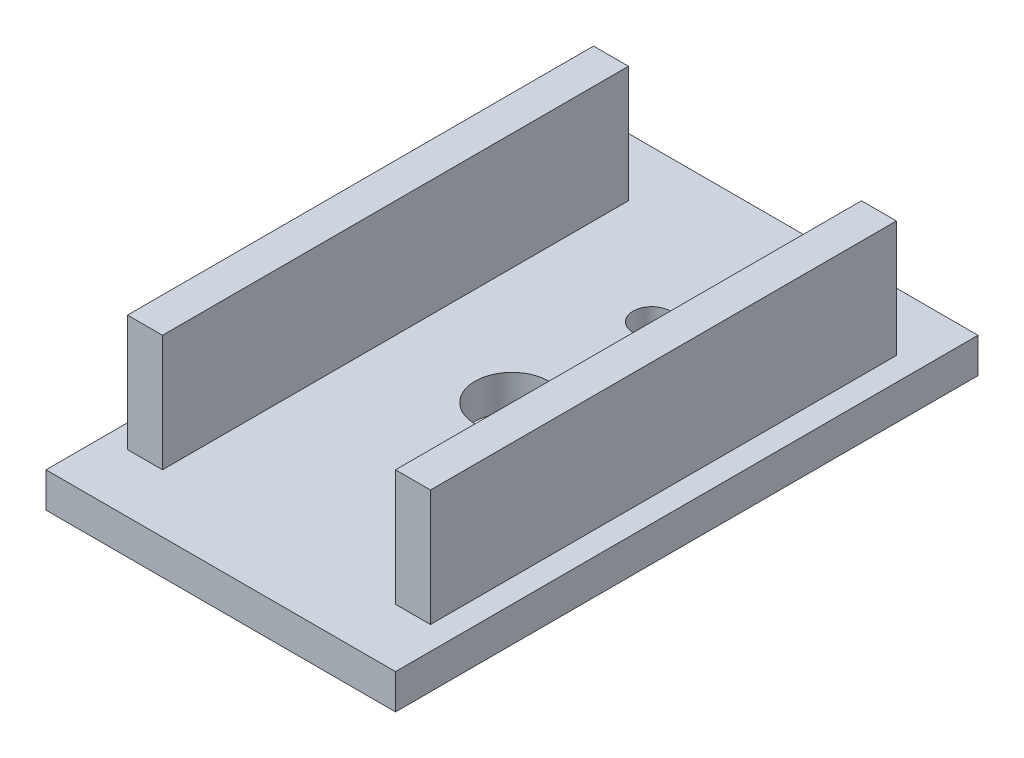
ISO-10303-21;
HEADER;
FILE_DESCRIPTION(('STEP AP214'),'2;1');
FILE_NAME('part.step','',(''),(''),'','','');
FILE_SCHEMA(('AUTOMOTIVE_DESIGN { 1 0 10303 214 1 1 1 1 }'));
ENDSEC;
DATA;
#1=APPLICATION_CONTEXT('core data for automotive mechanical design processes');
#2=APPLICATION_PROTOCOL_DEFINITION('international standard','automotive_design',2000,#1);
#3=PRODUCT_CONTEXT('',#1,'mechanical');
#4=PRODUCT('Part','Part','',(#3));
#5=PRODUCT_RELATED_PRODUCT_CATEGORY('part','',(#4));
#6=PRODUCT_DEFINITION_FORMATION('','',#4);
#7=PRODUCT_DEFINITION_CONTEXT('part definition',#1,'design');
#8=PRODUCT_DEFINITION('design','',#6,#7);
#9=PRODUCT_DEFINITION_SHAPE('','',#8);
#10=(LENGTH_UNIT() NAMED_UNIT(*) SI_UNIT(.MILLI.,.METRE.));
#11=(NAMED_UNIT(*) PLANE_ANGLE_UNIT() SI_UNIT($,.RADIAN.));
#12=(NAMED_UNIT(*) SI_UNIT($,.STERADIAN.) SOLID_ANGLE_UNIT());
#13=UNCERTAINTY_MEASURE_WITH_UNIT(LENGTH_MEASURE(1.E-05),#10,'distance_accuracy_value','');
#14=(GEOMETRIC_REPRESENTATION_CONTEXT(3) GLOBAL_UNCERTAINTY_ASSIGNED_CONTEXT((#13)) GLOBAL_UNIT_ASSIGNED_CONTEXT((#10,
#11,#12)) REPRESENTATION_CONTEXT('',''));
#15=CARTESIAN_POINT('',(0.,0.,0.));
#16=DIRECTION('',(0.,0.,1.));
#17=DIRECTION('',(1.,0.,0.));
#18=AXIS2_PLACEMENT_3D('',#15,#16,#17);
#19=CARTESIAN_POINT('',(0.,1.5,0.));
#20=DIRECTION('',(0.,1.,0.));
#21=DIRECTION('',(0.,0.,1.));
#22=AXIS2_PLACEMENT_3D('',#19,#20,#21);
#23=PLANE('',#22);
#24=DIRECTION('',(0.,0.,1.));
#25=VECTOR('',#24,1.);
#26=CARTESIAN_POINT('',(-10.,1.5,-20.));
#27=LINE('',#26,#25);
#28=CARTESIAN_POINT('',(-10.,1.5,-20.));
#29=VERTEX_POINT('',#28);
#30=CARTESIAN_POINT('',(-10.,1.5,20.));
#31=VERTEX_POINT('',#30);
#32=EDGE_CURVE('E127',#29,#31,#27,.T.);
#33=ORIENTED_EDGE('',*,*,#32,.T.);
#34=DIRECTION('',(-1.,0.,0.));
#35=VECTOR('',#34,1.);
#36=CARTESIAN_POINT('',(-10.,1.5,20.));
#37=LINE('',#36,#35);
#38=CARTESIAN_POINT('',(-13.,1.5,20.));
#39=VERTEX_POINT('',#38);
#40=EDGE_CURVE('E141',#31,#39,#37,.T.);
#41=ORIENTED_EDGE('',*,*,#40,.T.);
#42=DIRECTION('',(0.,0.,-1.));
#43=VECTOR('',#42,1.);
#44=CARTESIAN_POINT('',(-13.,1.5,-20.));
#45=LINE('',#44,#43);
#46=CARTESIAN_POINT('',(-13.,1.5,-20.));
#47=VERTEX_POINT('',#46);
#48=EDGE_CURVE('E53',#39,#47,#45,.T.);
#49=ORIENTED_EDGE('',*,*,#48,.T.);
#50=DIRECTION('',(1.,0.,0.));
#51=VECTOR('',#50,1.);
#52=CARTESIAN_POINT('',(-10.,1.5,-20.));
#53=LINE('',#52,#51);
#54=EDGE_CURVE('E48',#47,#29,#53,.T.);
#55=ORIENTED_EDGE('',*,*,#54,.T.);
#56=EDGE_LOOP('',(#33,#41,#49,#55));
#57=FACE_BOUND('',#56,.T.);
#58=CARTESIAN_POINT('',(0.,1.5,-12.));
#59=DIRECTION('',(0.,1.,0.));
#60=DIRECTION('',(0.,0.,1.));
#61=AXIS2_PLACEMENT_3D('',#58,#59,#60);
#62=CIRCLE('',#61,1.6);
#63=CARTESIAN_POINT('',(0.,1.5,-10.4));
#64=VERTEX_POINT('',#63);
#65=EDGE_CURVE('E187',#64,#64,#62,.T.);
#66=ORIENTED_EDGE('',*,*,#65,.F.);
#67=EDGE_LOOP('',(#66));
#68=FACE_BOUND('',#67,.T.);
#69=CARTESIAN_POINT('',(0.,1.5,0.));
#70=DIRECTION('',(0.,1.,0.));
#71=DIRECTION('',(0.,0.,1.));
#72=AXIS2_PLACEMENT_3D('',#69,#70,#71);
#73=CIRCLE('',#72,3.175);
#74=CARTESIAN_POINT('',(0.,1.5,3.175));
#75=VERTEX_POINT('',#74);
#76=EDGE_CURVE('E193',#75,#75,#73,.T.);
#77=ORIENTED_EDGE('',*,*,#76,.F.);
#78=EDGE_LOOP('',(#77));
#79=FACE_BOUND('',#78,.T.);
#80=DIRECTION('',(0.,0.,-1.));
#81=VECTOR('',#80,1.);
#82=CARTESIAN_POINT('',(15.,1.5,-25.));
#83=LINE('',#82,#81);
#84=CARTESIAN_POINT('',(15.,1.5,25.));
#85=VERTEX_POINT('',#84);
#86=CARTESIAN_POINT('',(15.,1.5,-25.));
#87=VERTEX_POINT('',#86);
#88=EDGE_CURVE('E200',#85,#87,#83,.T.);
#89=ORIENTED_EDGE('',*,*,#88,.T.);
#90=DIRECTION('',(-1.,0.,0.));
#91=VECTOR('',#90,1.);
#92=CARTESIAN_POINT('',(-15.,1.5,-25.));
#93=LINE('',#92,#91);
#94=CARTESIAN_POINT('',(-15.,1.5,-25.));
#95=VERTEX_POINT('',#94);
#96=EDGE_CURVE('E203',#87,#95,#93,.T.);
#97=ORIENTED_EDGE('',*,*,#96,.T.);
#98=DIRECTION('',(0.,0.,1.));
#99=VECTOR('',#98,1.);
#100=CARTESIAN_POINT('',(-15.,1.5,-25.));
#101=LINE('',#100,#99);
#102=CARTESIAN_POINT('',(-15.,1.5,25.));
#103=VERTEX_POINT('',#102);
#104=EDGE_CURVE('E206',#95,#103,#101,.T.);
#105=ORIENTED_EDGE('',*,*,#104,.T.);
#106=DIRECTION('',(1.,0.,0.));
#107=VECTOR('',#106,1.);
#108=CARTESIAN_POINT('',(-15.,1.5,25.));
#109=LINE('',#108,#107);
#110=EDGE_CURVE('E208',#103,#85,#109,.T.);
#111=ORIENTED_EDGE('',*,*,#110,.T.);
#112=EDGE_LOOP('',(#89,#97,#105,#111));
#113=FACE_BOUND('',#112,.T.);
#114=DIRECTION('',(1.,0.,0.));
#115=VECTOR('',#114,1.);
#116=CARTESIAN_POINT('',(10.,1.5,20.));
#117=LINE('',#116,#115);
#118=CARTESIAN_POINT('',(10.,1.5,20.));
#119=VERTEX_POINT('',#118);
#120=CARTESIAN_POINT('',(13.,1.5,20.));
#121=VERTEX_POINT('',#120);
#122=EDGE_CURVE('E172',#119,#121,#117,.T.);
#123=ORIENTED_EDGE('',*,*,#122,.F.);
#124=DIRECTION('',(0.,0.,1.));
#125=VECTOR('',#124,1.);
#126=CARTESIAN_POINT('',(10.,1.5,-20.));
#127=LINE('',#126,#125);
#128=CARTESIAN_POINT('',(10.,1.5,-20.));
#129=VERTEX_POINT('',#128);
#130=EDGE_CURVE('E130',#129,#119,#127,.T.);
#131=ORIENTED_EDGE('',*,*,#130,.F.);
#132=DIRECTION('',(-1.,0.,0.));
#133=VECTOR('',#132,1.);
#134=CARTESIAN_POINT('',(10.,1.5,-20.));
#135=LINE('',#134,#133);
#136=CARTESIAN_POINT('',(13.,1.5,-20.));
#137=VERTEX_POINT('',#136);
#138=EDGE_CURVE('E163',#137,#129,#135,.T.);
#139=ORIENTED_EDGE('',*,*,#138,.F.);
#140=DIRECTION('',(0.,0.,-1.));
#141=VECTOR('',#140,1.);
#142=CARTESIAN_POINT('',(13.,1.5,-20.));
#143=LINE('',#142,#141);
#144=EDGE_CURVE('E174',#121,#137,#143,.T.);
#145=ORIENTED_EDGE('',*,*,#144,.F.);
#146=EDGE_LOOP('',(#123,#131,#139,#145));
#147=FACE_BOUND('',#146,.T.);
#148=ADVANCED_FACE('F33',(#57,#68,#79,#113,#147),#23,.T.);
#149=CARTESIAN_POINT('',(15.,1.5,-25.));
#150=DIRECTION('',(-1.,0.,0.));
#151=DIRECTION('',(0.,0.,1.));
#152=AXIS2_PLACEMENT_3D('',#149,#150,#151);
#153=PLANE('',#152);
#154=DIRECTION('',(0.,0.,-1.));
#155=VECTOR('',#154,1.);
#156=CARTESIAN_POINT('',(15.,-1.5,-25.));
#157=LINE('',#156,#155);
#158=CARTESIAN_POINT('',(15.,-1.5,25.));
#159=VERTEX_POINT('',#158);
#160=CARTESIAN_POINT('',(15.,-1.5,-25.));
#161=VERTEX_POINT('',#160);
#162=EDGE_CURVE('E199',#159,#161,#157,.T.);
#163=ORIENTED_EDGE('',*,*,#162,.T.);
#164=DIRECTION('',(0.,-1.,0.));
#165=VECTOR('',#164,1.);
#166=CARTESIAN_POINT('',(15.,1.5,-25.));
#167=LINE('',#166,#165);
#168=EDGE_CURVE('E11',#87,#161,#167,.T.);
#169=ORIENTED_EDGE('',*,*,#168,.F.);
#170=ORIENTED_EDGE('',*,*,#88,.F.);
#171=DIRECTION('',(0.,-1.,0.));
#172=VECTOR('',#171,1.);
#173=CARTESIAN_POINT('',(15.,1.5,25.));
#174=LINE('',#173,#172);
#175=EDGE_CURVE('E210',#85,#159,#174,.T.);
#176=ORIENTED_EDGE('',*,*,#175,.T.);
#177=EDGE_LOOP('',(#163,#169,#170,#176));
#178=FACE_BOUND('',#177,.T.);
#179=ADVANCED_FACE('F35',(#178),#153,.F.);
#180=CARTESIAN_POINT('',(-15.,1.5,-25.));
#181=DIRECTION('',(0.,0.,1.));
#182=DIRECTION('',(1.,0.,0.));
#183=AXIS2_PLACEMENT_3D('',#180,#181,#182);
#184=PLANE('',#183);
#185=DIRECTION('',(-1.,0.,0.));
#186=VECTOR('',#185,1.);
#187=CARTESIAN_POINT('',(-15.,-1.5,-25.));
#188=LINE('',#187,#186);
#189=CARTESIAN_POINT('',(-15.,-1.5,-25.));
#190=VERTEX_POINT('',#189);
#191=EDGE_CURVE('E213',#161,#190,#188,.T.);
#192=ORIENTED_EDGE('',*,*,#191,.T.);
#193=DIRECTION('',(0.,-1.,0.));
#194=VECTOR('',#193,1.);
#195=CARTESIAN_POINT('',(-15.,1.5,-25.));
#196=LINE('',#195,#194);
#197=EDGE_CURVE('E41',#95,#190,#196,.T.);
#198=ORIENTED_EDGE('',*,*,#197,.F.);
#199=ORIENTED_EDGE('',*,*,#96,.F.);
#200=ORIENTED_EDGE('',*,*,#168,.T.);
#201=EDGE_LOOP('',(#192,#198,#199,#200));
#202=FACE_BOUND('',#201,.T.);
#203=ADVANCED_FACE('F243',(#202),#184,.F.);
#204=CARTESIAN_POINT('',(-15.,1.5,-25.));
#205=DIRECTION('',(1.,0.,0.));
#206=DIRECTION('',(0.,0.,-1.));
#207=AXIS2_PLACEMENT_3D('',#204,#205,#206);
#208=PLANE('',#207);
#209=DIRECTION('',(0.,0.,1.));
#210=VECTOR('',#209,1.);
#211=CARTESIAN_POINT('',(-15.,-1.5,-25.));
#212=LINE('',#211,#210);
#213=CARTESIAN_POINT('',(-15.,-1.5,25.));
#214=VERTEX_POINT('',#213);
#215=EDGE_CURVE('E215',#190,#214,#212,.T.);
#216=ORIENTED_EDGE('',*,*,#215,.T.);
#217=DIRECTION('',(0.,-1.,0.));
#218=VECTOR('',#217,1.);
#219=CARTESIAN_POINT('',(-15.,1.5,25.));
#220=LINE('',#219,#218);
#221=EDGE_CURVE('E220',#103,#214,#220,.T.);
#222=ORIENTED_EDGE('',*,*,#221,.F.);
#223=ORIENTED_EDGE('',*,*,#104,.F.);
#224=ORIENTED_EDGE('',*,*,#197,.T.);
#225=EDGE_LOOP('',(#216,#222,#223,#224));
#226=FACE_BOUND('',#225,.T.);
#227=ADVANCED_FACE('F227',(#226),#208,.F.);
#228=CARTESIAN_POINT('',(-15.,1.5,25.));
#229=DIRECTION('',(0.,0.,-1.));
#230=DIRECTION('',(-1.,0.,0.));
#231=AXIS2_PLACEMENT_3D('',#228,#229,#230);
#232=PLANE('',#231);
#233=DIRECTION('',(1.,0.,0.));
#234=VECTOR('',#233,1.);
#235=CARTESIAN_POINT('',(-15.,-1.5,25.));
#236=LINE('',#235,#234);
#237=EDGE_CURVE('E204',#214,#159,#236,.T.);
#238=ORIENTED_EDGE('',*,*,#237,.T.);
#239=ORIENTED_EDGE('',*,*,#175,.F.);
#240=ORIENTED_EDGE('',*,*,#110,.F.);
#241=ORIENTED_EDGE('',*,*,#221,.T.);
#242=EDGE_LOOP('',(#238,#239,#240,#241));
#243=FACE_BOUND('',#242,.T.);
#244=ADVANCED_FACE('F236',(#243),#232,.F.);
#245=CARTESIAN_POINT('',(0.,-1.5,0.));
#246=DIRECTION('',(0.,1.,0.));
#247=DIRECTION('',(0.,0.,1.));
#248=AXIS2_PLACEMENT_3D('',#245,#246,#247);
#249=PLANE('',#248);
#250=CARTESIAN_POINT('',(0.,-1.5,-12.));
#251=DIRECTION('',(0.,1.,0.));
#252=DIRECTION('',(0.,0.,1.));
#253=AXIS2_PLACEMENT_3D('',#250,#251,#252);
#254=CIRCLE('',#253,1.6);
#255=CARTESIAN_POINT('',(0.,-1.5,-10.4));
#256=VERTEX_POINT('',#255);
#257=EDGE_CURVE('E190',#256,#256,#254,.F.);
#258=ORIENTED_EDGE('',*,*,#257,.F.);
#259=EDGE_LOOP('',(#258));
#260=FACE_BOUND('',#259,.T.);
#261=CARTESIAN_POINT('',(0.,-1.5,0.));
#262=DIRECTION('',(0.,1.,0.));
#263=DIRECTION('',(0.,0.,1.));
#264=AXIS2_PLACEMENT_3D('',#261,#262,#263);
#265=CIRCLE('',#264,3.175);
#266=CARTESIAN_POINT('',(0.,-1.5,3.175));
#267=VERTEX_POINT('',#266);
#268=EDGE_CURVE('E196',#267,#267,#265,.F.);
#269=ORIENTED_EDGE('',*,*,#268,.F.);
#270=EDGE_LOOP('',(#269));
#271=FACE_BOUND('',#270,.T.);
#272=ORIENTED_EDGE('',*,*,#162,.F.);
#273=ORIENTED_EDGE('',*,*,#237,.F.);
#274=ORIENTED_EDGE('',*,*,#215,.F.);
#275=ORIENTED_EDGE('',*,*,#191,.F.);
#276=EDGE_LOOP('',(#272,#273,#274,#275));
#277=FACE_BOUND('',#276,.T.);
#278=ADVANCED_FACE('F233',(#260,#271,#277),#249,.F.);
#279=CARTESIAN_POINT('',(0.,-10.4802561210692,0.));
#280=DIRECTION('',(0.,1.,0.));
#281=DIRECTION('',(0.,0.,1.));
#282=AXIS2_PLACEMENT_3D('',#279,#280,#281);
#283=CYLINDRICAL_SURFACE('',#282,3.175);
#284=ORIENTED_EDGE('',*,*,#268,.T.);
#285=EDGE_LOOP('',(#284));
#286=FACE_BOUND('',#285,.T.);
#287=ORIENTED_EDGE('',*,*,#76,.T.);
#288=EDGE_LOOP('',(#287));
#289=FACE_BOUND('',#288,.T.);
#290=ADVANCED_FACE('F259',(#286,#289),#283,.F.);
#291=CARTESIAN_POINT('',(0.,-10.4802561210692,-12.));
#292=DIRECTION('',(0.,1.,0.));
#293=DIRECTION('',(0.,0.,1.));
#294=AXIS2_PLACEMENT_3D('',#291,#292,#293);
#295=CYLINDRICAL_SURFACE('',#294,1.6);
#296=ORIENTED_EDGE('',*,*,#257,.T.);
#297=EDGE_LOOP('',(#296));
#298=FACE_BOUND('',#297,.T.);
#299=ORIENTED_EDGE('',*,*,#65,.T.);
#300=EDGE_LOOP('',(#299));
#301=FACE_BOUND('',#300,.T.);
#302=ADVANCED_FACE('F279',(#298,#301),#295,.F.);
#303=CARTESIAN_POINT('',(10.,11.5,-20.));
#304=DIRECTION('',(1.,0.,0.));
#305=DIRECTION('',(0.,0.,-1.));
#306=AXIS2_PLACEMENT_3D('',#303,#304,#305);
#307=PLANE('',#306);
#308=ORIENTED_EDGE('',*,*,#130,.T.);
#309=DIRECTION('',(0.,-1.,0.));
#310=VECTOR('',#309,1.);
#311=CARTESIAN_POINT('',(10.,11.5,20.));
#312=LINE('',#311,#310);
#313=CARTESIAN_POINT('',(10.,11.5,20.));
#314=VERTEX_POINT('',#313);
#315=EDGE_CURVE('E185',#314,#119,#312,.T.);
#316=ORIENTED_EDGE('',*,*,#315,.F.);
#317=DIRECTION('',(0.,0.,1.));
#318=VECTOR('',#317,1.);
#319=CARTESIAN_POINT('',(10.,11.5,-20.));
#320=LINE('',#319,#318);
#321=CARTESIAN_POINT('',(10.,11.5,-20.));
#322=VERTEX_POINT('',#321);
#323=EDGE_CURVE('E159',#322,#314,#320,.T.);
#324=ORIENTED_EDGE('',*,*,#323,.F.);
#325=DIRECTION('',(0.,-1.,0.));
#326=VECTOR('',#325,1.);
#327=CARTESIAN_POINT('',(10.,11.5,-20.));
#328=LINE('',#327,#326);
#329=EDGE_CURVE('E169',#322,#129,#328,.T.);
#330=ORIENTED_EDGE('',*,*,#329,.T.);
#331=EDGE_LOOP('',(#308,#316,#324,#330));
#332=FACE_BOUND('',#331,.T.);
#333=ADVANCED_FACE('F286',(#332),#307,.F.);
#334=CARTESIAN_POINT('',(10.,11.5,20.));
#335=DIRECTION('',(0.,0.,-1.));
#336=DIRECTION('',(-1.,0.,0.));
#337=AXIS2_PLACEMENT_3D('',#334,#335,#336);
#338=PLANE('',#337);
#339=ORIENTED_EDGE('',*,*,#122,.T.);
#340=DIRECTION('',(0.,-1.,0.));
#341=VECTOR('',#340,1.);
#342=CARTESIAN_POINT('',(13.,11.5,20.));
#343=LINE('',#342,#341);
#344=CARTESIAN_POINT('',(13.,11.5,20.));
#345=VERTEX_POINT('',#344);
#346=EDGE_CURVE('E182',#345,#121,#343,.T.);
#347=ORIENTED_EDGE('',*,*,#346,.F.);
#348=DIRECTION('',(1.,0.,0.));
#349=VECTOR('',#348,1.);
#350=CARTESIAN_POINT('',(10.,11.5,20.));
#351=LINE('',#350,#349);
#352=EDGE_CURVE('E162',#314,#345,#351,.T.);
#353=ORIENTED_EDGE('',*,*,#352,.F.);
#354=ORIENTED_EDGE('',*,*,#315,.T.);
#355=EDGE_LOOP('',(#339,#347,#353,#354));
#356=FACE_BOUND('',#355,.T.);
#357=ADVANCED_FACE('F298',(#356),#338,.F.);
#358=CARTESIAN_POINT('',(13.,11.5,-20.));
#359=DIRECTION('',(-1.,0.,0.));
#360=DIRECTION('',(0.,0.,1.));
#361=AXIS2_PLACEMENT_3D('',#358,#359,#360);
#362=PLANE('',#361);
#363=ORIENTED_EDGE('',*,*,#144,.T.);
#364=DIRECTION('',(0.,-1.,0.));
#365=VECTOR('',#364,1.);
#366=CARTESIAN_POINT('',(13.,11.5,-20.));
#367=LINE('',#366,#365);
#368=CARTESIAN_POINT('',(13.,11.5,-20.));
#369=VERTEX_POINT('',#368);
#370=EDGE_CURVE('E180',#369,#137,#367,.T.);
#371=ORIENTED_EDGE('',*,*,#370,.F.);
#372=DIRECTION('',(0.,0.,-1.));
#373=VECTOR('',#372,1.);
#374=CARTESIAN_POINT('',(13.,11.5,-20.));
#375=LINE('',#374,#373);
#376=EDGE_CURVE('E165',#345,#369,#375,.T.);
#377=ORIENTED_EDGE('',*,*,#376,.F.);
#378=ORIENTED_EDGE('',*,*,#346,.T.);
#379=EDGE_LOOP('',(#363,#371,#377,#378));
#380=FACE_BOUND('',#379,.T.);
#381=ADVANCED_FACE('F305',(#380),#362,.F.);
#382=CARTESIAN_POINT('',(10.,11.5,-20.));
#383=DIRECTION('',(0.,0.,1.));
#384=DIRECTION('',(1.,0.,0.));
#385=AXIS2_PLACEMENT_3D('',#382,#383,#384);
#386=PLANE('',#385);
#387=ORIENTED_EDGE('',*,*,#138,.T.);
#388=ORIENTED_EDGE('',*,*,#329,.F.);
#389=DIRECTION('',(-1.,0.,0.));
#390=VECTOR('',#389,1.);
#391=CARTESIAN_POINT('',(10.,11.5,-20.));
#392=LINE('',#391,#390);
#393=EDGE_CURVE('E167',#369,#322,#392,.T.);
#394=ORIENTED_EDGE('',*,*,#393,.F.);
#395=ORIENTED_EDGE('',*,*,#370,.T.);
#396=EDGE_LOOP('',(#387,#388,#394,#395));
#397=FACE_BOUND('',#396,.T.);
#398=ADVANCED_FACE('F313',(#397),#386,.F.);
#399=CARTESIAN_POINT('',(0.,11.5,0.));
#400=DIRECTION('',(0.,1.,0.));
#401=DIRECTION('',(0.,0.,1.));
#402=AXIS2_PLACEMENT_3D('',#399,#400,#401);
#403=PLANE('',#402);
#404=ORIENTED_EDGE('',*,*,#323,.T.);
#405=ORIENTED_EDGE('',*,*,#352,.T.);
#406=ORIENTED_EDGE('',*,*,#376,.T.);
#407=ORIENTED_EDGE('',*,*,#393,.T.);
#408=EDGE_LOOP('',(#404,#405,#406,#407));
#409=FACE_BOUND('',#408,.T.);
#410=ADVANCED_FACE('F321',(#409),#403,.T.);
#411=CARTESIAN_POINT('',(-10.,11.5,-20.));
#412=DIRECTION('',(1.,0.,0.));
#413=DIRECTION('',(0.,0.,-1.));
#414=AXIS2_PLACEMENT_3D('',#411,#412,#413);
#415=PLANE('',#414);
#416=ORIENTED_EDGE('',*,*,#32,.F.);
#417=DIRECTION('',(0.,-1.,0.));
#418=VECTOR('',#417,1.);
#419=CARTESIAN_POINT('',(-10.,11.5,-20.));
#420=LINE('',#419,#418);
#421=CARTESIAN_POINT('',(-10.,11.5,-20.));
#422=VERTEX_POINT('',#421);
#423=EDGE_CURVE('E121',#422,#29,#420,.T.);
#424=ORIENTED_EDGE('',*,*,#423,.F.);
#425=DIRECTION('',(0.,0.,1.));
#426=VECTOR('',#425,1.);
#427=CARTESIAN_POINT('',(-10.,11.5,-20.));
#428=LINE('',#427,#426);
#429=CARTESIAN_POINT('',(-10.,11.5,20.));
#430=VERTEX_POINT('',#429);
#431=EDGE_CURVE('E125',#422,#430,#428,.T.);
#432=ORIENTED_EDGE('',*,*,#431,.T.);
#433=DIRECTION('',(0.,-1.,0.));
#434=VECTOR('',#433,1.);
#435=CARTESIAN_POINT('',(-10.,11.5,20.));
#436=LINE('',#435,#434);
#437=EDGE_CURVE('E149',#430,#31,#436,.T.);
#438=ORIENTED_EDGE('',*,*,#437,.T.);
#439=EDGE_LOOP('',(#416,#424,#432,#438));
#440=FACE_BOUND('',#439,.T.);
#441=ADVANCED_FACE('F123',(#440),#415,.T.);
#442=CARTESIAN_POINT('',(-10.,11.5,-20.));
#443=DIRECTION('',(0.,0.,-1.));
#444=DIRECTION('',(-1.,0.,0.));
#445=AXIS2_PLACEMENT_3D('',#442,#443,#444);
#446=PLANE('',#445);
#447=ORIENTED_EDGE('',*,*,#54,.F.);
#448=DIRECTION('',(0.,-1.,0.));
#449=VECTOR('',#448,1.);
#450=CARTESIAN_POINT('',(-13.,11.5,-20.));
#451=LINE('',#450,#449);
#452=CARTESIAN_POINT('',(-13.,11.5,-20.));
#453=VERTEX_POINT('',#452);
#454=EDGE_CURVE('E131',#453,#47,#451,.T.);
#455=ORIENTED_EDGE('',*,*,#454,.F.);
#456=DIRECTION('',(1.,0.,0.));
#457=VECTOR('',#456,1.);
#458=CARTESIAN_POINT('',(-10.,11.5,-20.));
#459=LINE('',#458,#457);
#460=EDGE_CURVE('E137',#453,#422,#459,.T.);
#461=ORIENTED_EDGE('',*,*,#460,.T.);
#462=ORIENTED_EDGE('',*,*,#423,.T.);
#463=EDGE_LOOP('',(#447,#455,#461,#462));
#464=FACE_BOUND('',#463,.T.);
#465=ADVANCED_FACE('F143',(#464),#446,.T.);
#466=CARTESIAN_POINT('',(-13.,11.5,-20.));
#467=DIRECTION('',(-1.,0.,0.));
#468=DIRECTION('',(0.,0.,1.));
#469=AXIS2_PLACEMENT_3D('',#466,#467,#468);
#470=PLANE('',#469);
#471=ORIENTED_EDGE('',*,*,#48,.F.);
#472=DIRECTION('',(0.,-1.,0.));
#473=VECTOR('',#472,1.);
#474=CARTESIAN_POINT('',(-13.,11.5,20.));
#475=LINE('',#474,#473);
#476=CARTESIAN_POINT('',(-13.,11.5,20.));
#477=VERTEX_POINT('',#476);
#478=EDGE_CURVE('E155',#477,#39,#475,.T.);
#479=ORIENTED_EDGE('',*,*,#478,.F.);
#480=DIRECTION('',(0.,0.,-1.));
#481=VECTOR('',#480,1.);
#482=CARTESIAN_POINT('',(-13.,11.5,-20.));
#483=LINE('',#482,#481);
#484=EDGE_CURVE('E144',#477,#453,#483,.T.);
#485=ORIENTED_EDGE('',*,*,#484,.T.);
#486=ORIENTED_EDGE('',*,*,#454,.T.);
#487=EDGE_LOOP('',(#471,#479,#485,#486));
#488=FACE_BOUND('',#487,.T.);
#489=ADVANCED_FACE('F340',(#488),#470,.T.);
#490=CARTESIAN_POINT('',(-10.,11.5,20.));
#491=DIRECTION('',(0.,0.,1.));
#492=DIRECTION('',(1.,0.,0.));
#493=AXIS2_PLACEMENT_3D('',#490,#491,#492);
#494=PLANE('',#493);
#495=ORIENTED_EDGE('',*,*,#40,.F.);
#496=ORIENTED_EDGE('',*,*,#437,.F.);
#497=DIRECTION('',(-1.,0.,0.));
#498=VECTOR('',#497,1.);
#499=CARTESIAN_POINT('',(-10.,11.5,20.));
#500=LINE('',#499,#498);
#501=EDGE_CURVE('E140',#430,#477,#500,.T.);
#502=ORIENTED_EDGE('',*,*,#501,.T.);
#503=ORIENTED_EDGE('',*,*,#478,.T.);
#504=EDGE_LOOP('',(#495,#496,#502,#503));
#505=FACE_BOUND('',#504,.T.);
#506=ADVANCED_FACE('F347',(#505),#494,.T.);
#507=CARTESIAN_POINT('',(0.,11.5,0.));
#508=DIRECTION('',(0.,1.,0.));
#509=DIRECTION('',(0.,0.,1.));
#510=AXIS2_PLACEMENT_3D('',#507,#508,#509);
#511=PLANE('',#510);
#512=ORIENTED_EDGE('',*,*,#431,.F.);
#513=ORIENTED_EDGE('',*,*,#460,.F.);
#514=ORIENTED_EDGE('',*,*,#484,.F.);
#515=ORIENTED_EDGE('',*,*,#501,.F.);
#516=EDGE_LOOP('',(#512,#513,#514,#515));
#517=FACE_BOUND('',#516,.T.);
#518=ADVANCED_FACE('F135',(#517),#511,.T.);
#519=CLOSED_SHELL('',(#148,#179,#203,#227,#244,#278,#290,#302,#333,#357,#381,#398,#410,#441,
#465,#489,#506,#518));
#520=MANIFOLD_SOLID_BREP('B2',#519);
#521=ADVANCED_BREP_SHAPE_REPRESENTATION('',(#18,#520),#14);
#522=SHAPE_DEFINITION_REPRESENTATION(#9,#521);
ENDSEC;
END-ISO-10303-21;
